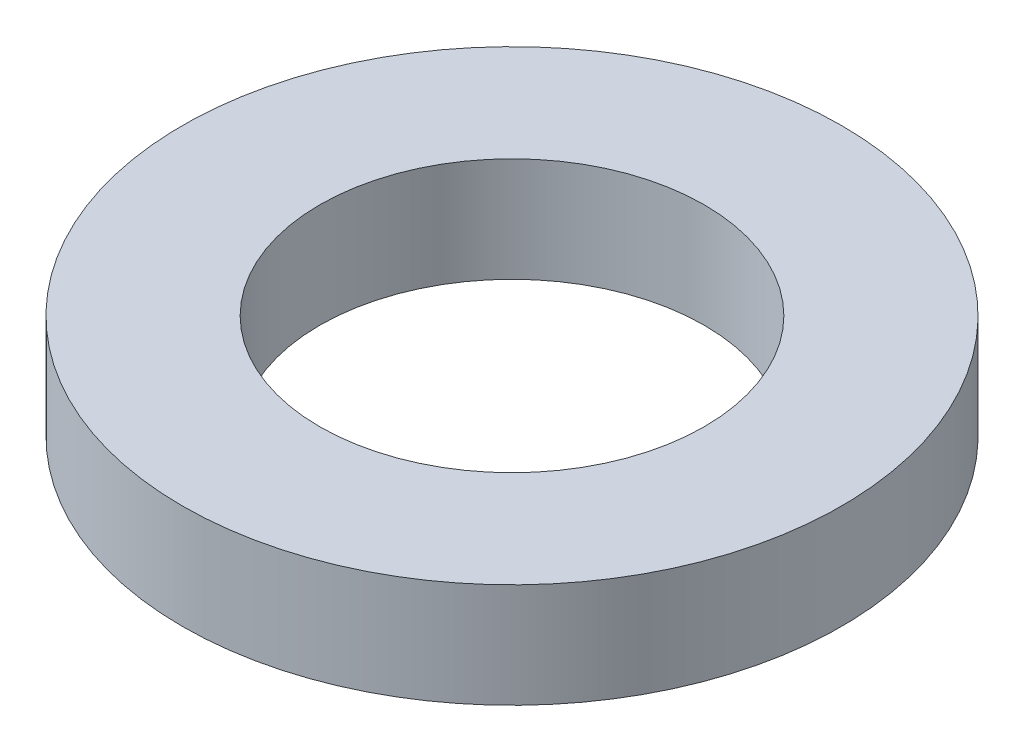
ISO-10303-21;
HEADER;
FILE_DESCRIPTION(('STEP AP214'),'2;1');
FILE_NAME('part.step','',(''),(''),'','','');
FILE_SCHEMA(('AUTOMOTIVE_DESIGN { 1 0 10303 214 1 1 1 1 }'));
ENDSEC;
DATA;
#1=APPLICATION_CONTEXT('core data for automotive mechanical design processes');
#2=APPLICATION_PROTOCOL_DEFINITION('international standard','automotive_design',2000,#1);
#3=PRODUCT_CONTEXT('',#1,'mechanical');
#4=PRODUCT('Part','Part','',(#3));
#5=PRODUCT_RELATED_PRODUCT_CATEGORY('part','',(#4));
#6=PRODUCT_DEFINITION_FORMATION('','',#4);
#7=PRODUCT_DEFINITION_CONTEXT('part definition',#1,'design');
#8=PRODUCT_DEFINITION('design','',#6,#7);
#9=PRODUCT_DEFINITION_SHAPE('','',#8);
#10=(LENGTH_UNIT() NAMED_UNIT(*) SI_UNIT(.MILLI.,.METRE.));
#11=(NAMED_UNIT(*) PLANE_ANGLE_UNIT() SI_UNIT($,.RADIAN.));
#12=(NAMED_UNIT(*) SI_UNIT($,.STERADIAN.) SOLID_ANGLE_UNIT());
#13=UNCERTAINTY_MEASURE_WITH_UNIT(LENGTH_MEASURE(1.E-05),#10,'distance_accuracy_value','');
#14=(GEOMETRIC_REPRESENTATION_CONTEXT(3) GLOBAL_UNCERTAINTY_ASSIGNED_CONTEXT((#13)) GLOBAL_UNIT_ASSIGNED_CONTEXT((#10,
#11,#12)) REPRESENTATION_CONTEXT('',''));
#15=CARTESIAN_POINT('',(0.,0.,0.));
#16=DIRECTION('',(0.,0.,1.));
#17=DIRECTION('',(1.,0.,0.));
#18=AXIS2_PLACEMENT_3D('',#15,#16,#17);
#19=CARTESIAN_POINT('',(0.,19.,0.));
#20=DIRECTION('',(0.,-1.,0.));
#21=DIRECTION('',(0.,0.,-1.));
#22=AXIS2_PLACEMENT_3D('',#19,#20,#21);
#23=CYLINDRICAL_SURFACE('',#22,60.);
#24=CARTESIAN_POINT('',(0.,19.,0.));
#25=DIRECTION('',(0.,1.,0.));
#26=DIRECTION('',(0.,0.,1.));
#27=AXIS2_PLACEMENT_3D('',#24,#25,#26);
#28=CIRCLE('',#27,60.);
#29=CARTESIAN_POINT('',(0.,19.,60.));
#30=VERTEX_POINT('',#29);
#31=EDGE_CURVE('E10',#30,#30,#28,.T.);
#32=ORIENTED_EDGE('',*,*,#31,.F.);
#33=EDGE_LOOP('',(#32));
#34=FACE_BOUND('',#33,.T.);
#35=CARTESIAN_POINT('',(0.,0.,0.));
#36=DIRECTION('',(0.,1.,0.));
#37=DIRECTION('',(0.,0.,1.));
#38=AXIS2_PLACEMENT_3D('',#35,#36,#37);
#39=CIRCLE('',#38,60.);
#40=CARTESIAN_POINT('',(0.,0.,60.));
#41=VERTEX_POINT('',#40);
#42=EDGE_CURVE('E37',#41,#41,#39,.T.);
#43=ORIENTED_EDGE('',*,*,#42,.T.);
#44=EDGE_LOOP('',(#43));
#45=FACE_BOUND('',#44,.T.);
#46=ADVANCED_FACE('F40',(#34,#45),#23,.T.);
#47=CARTESIAN_POINT('',(0.,19.,0.));
#48=DIRECTION('',(0.,1.,0.));
#49=DIRECTION('',(0.,0.,1.));
#50=AXIS2_PLACEMENT_3D('',#47,#48,#49);
#51=PLANE('',#50);
#52=CARTESIAN_POINT('',(0.,19.,0.));
#53=DIRECTION('',(0.,1.,0.));
#54=DIRECTION('',(0.,0.,1.));
#55=AXIS2_PLACEMENT_3D('',#52,#53,#54);
#56=CIRCLE('',#55,35.);
#57=CARTESIAN_POINT('',(0.,19.,35.));
#58=VERTEX_POINT('',#57);
#59=EDGE_CURVE('E50',#58,#58,#56,.T.);
#60=ORIENTED_EDGE('',*,*,#59,.F.);
#61=EDGE_LOOP('',(#60));
#62=FACE_BOUND('',#61,.T.);
#63=ORIENTED_EDGE('',*,*,#31,.T.);
#64=EDGE_LOOP('',(#63));
#65=FACE_BOUND('',#64,.T.);
#66=ADVANCED_FACE('F59',(#62,#65),#51,.T.);
#67=CARTESIAN_POINT('',(0.,0.,0.));
#68=DIRECTION('',(0.,1.,0.));
#69=DIRECTION('',(0.,0.,1.));
#70=AXIS2_PLACEMENT_3D('',#67,#68,#69);
#71=PLANE('',#70);
#72=CARTESIAN_POINT('',(0.,0.,0.));
#73=DIRECTION('',(0.,1.,0.));
#74=DIRECTION('',(0.,0.,1.));
#75=AXIS2_PLACEMENT_3D('',#72,#73,#74);
#76=CIRCLE('',#75,35.);
#77=CARTESIAN_POINT('',(0.,0.,35.));
#78=VERTEX_POINT('',#77);
#79=EDGE_CURVE('E47',#78,#78,#76,.T.);
#80=ORIENTED_EDGE('',*,*,#79,.T.);
#81=EDGE_LOOP('',(#80));
#82=FACE_BOUND('',#81,.T.);
#83=ORIENTED_EDGE('',*,*,#42,.F.);
#84=EDGE_LOOP('',(#83));
#85=FACE_BOUND('',#84,.T.);
#86=ADVANCED_FACE('F58',(#82,#85),#71,.F.);
#87=CARTESIAN_POINT('',(0.,19.,0.));
#88=DIRECTION('',(0.,-1.,0.));
#89=DIRECTION('',(0.,0.,-1.));
#90=AXIS2_PLACEMENT_3D('',#87,#88,#89);
#91=CYLINDRICAL_SURFACE('',#90,35.);
#92=ORIENTED_EDGE('',*,*,#59,.T.);
#93=EDGE_LOOP('',(#92));
#94=FACE_BOUND('',#93,.T.);
#95=ORIENTED_EDGE('',*,*,#79,.F.);
#96=EDGE_LOOP('',(#95));
#97=FACE_BOUND('',#96,.T.);
#98=ADVANCED_FACE('F54',(#94,#97),#91,.F.);
#99=CLOSED_SHELL('',(#46,#66,#86,#98));
#100=MANIFOLD_SOLID_BREP('B2',#99);
#101=ADVANCED_BREP_SHAPE_REPRESENTATION('',(#18,#100),#14);
#102=SHAPE_DEFINITION_REPRESENTATION(#9,#101);
ENDSEC;
END-ISO-10303-21;
